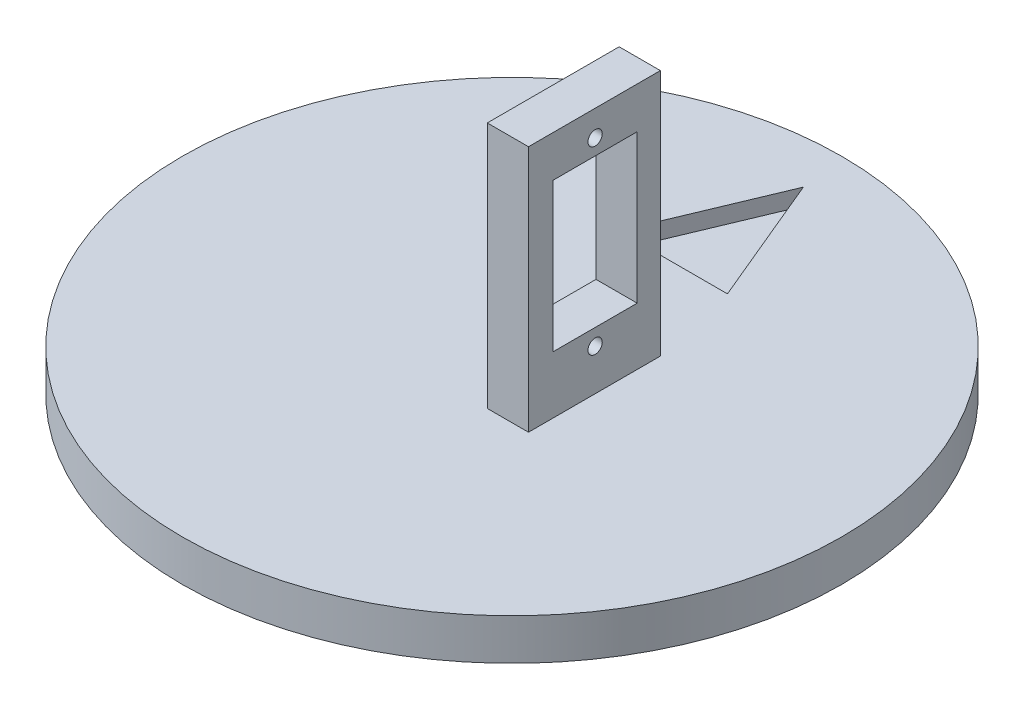
ISO-10303-21;
HEADER;
FILE_DESCRIPTION(('STEP AP214'),'2;1');
FILE_NAME('part.step','',(''),(''),'','','');
FILE_SCHEMA(('AUTOMOTIVE_DESIGN { 1 0 10303 214 1 1 1 1 }'));
ENDSEC;
DATA;
#1=APPLICATION_CONTEXT('core data for automotive mechanical design processes');
#2=APPLICATION_PROTOCOL_DEFINITION('international standard','automotive_design',2000,#1);
#3=PRODUCT_CONTEXT('',#1,'mechanical');
#4=PRODUCT('Part','Part','',(#3));
#5=PRODUCT_RELATED_PRODUCT_CATEGORY('part','',(#4));
#6=PRODUCT_DEFINITION_FORMATION('','',#4);
#7=PRODUCT_DEFINITION_CONTEXT('part definition',#1,'design');
#8=PRODUCT_DEFINITION('design','',#6,#7);
#9=PRODUCT_DEFINITION_SHAPE('','',#8);
#10=(LENGTH_UNIT() NAMED_UNIT(*) SI_UNIT(.MILLI.,.METRE.));
#11=(NAMED_UNIT(*) PLANE_ANGLE_UNIT() SI_UNIT($,.RADIAN.));
#12=(NAMED_UNIT(*) SI_UNIT($,.STERADIAN.) SOLID_ANGLE_UNIT());
#13=UNCERTAINTY_MEASURE_WITH_UNIT(LENGTH_MEASURE(1.E-05),#10,'distance_accuracy_value','');
#14=(GEOMETRIC_REPRESENTATION_CONTEXT(3) GLOBAL_UNCERTAINTY_ASSIGNED_CONTEXT((#13)) GLOBAL_UNIT_ASSIGNED_CONTEXT((#10,
#11,#12)) REPRESENTATION_CONTEXT('',''));
#15=CARTESIAN_POINT('',(0.,0.,0.));
#16=DIRECTION('',(0.,0.,1.));
#17=DIRECTION('',(1.,0.,0.));
#18=AXIS2_PLACEMENT_3D('',#15,#16,#17);
#19=CARTESIAN_POINT('',(0.,6.35,0.));
#20=DIRECTION('',(0.,-1.,0.));
#21=DIRECTION('',(0.,0.,-1.));
#22=AXIS2_PLACEMENT_3D('',#19,#20,#21);
#23=CYLINDRICAL_SURFACE('',#22,50.8);
#24=CARTESIAN_POINT('',(0.,6.35,0.));
#25=DIRECTION('',(0.,1.,0.));
#26=DIRECTION('',(0.,0.,1.));
#27=AXIS2_PLACEMENT_3D('',#24,#25,#26);
#28=CIRCLE('',#27,50.8);
#29=CARTESIAN_POINT('',(0.,6.35,50.8));
#30=VERTEX_POINT('',#29);
#31=EDGE_CURVE('E11',#30,#30,#28,.T.);
#32=ORIENTED_EDGE('',*,*,#31,.F.);
#33=EDGE_LOOP('',(#32));
#34=FACE_BOUND('',#33,.T.);
#35=CARTESIAN_POINT('',(0.,0.,0.));
#36=DIRECTION('',(0.,1.,0.));
#37=DIRECTION('',(0.,0.,1.));
#38=AXIS2_PLACEMENT_3D('',#35,#36,#37);
#39=CIRCLE('',#38,50.8);
#40=CARTESIAN_POINT('',(0.,0.,50.8));
#41=VERTEX_POINT('',#40);
#42=EDGE_CURVE('E45',#41,#41,#39,.T.);
#43=ORIENTED_EDGE('',*,*,#42,.T.);
#44=EDGE_LOOP('',(#43));
#45=FACE_BOUND('',#44,.T.);
#46=ADVANCED_FACE('F42',(#34,#45),#23,.T.);
#47=CARTESIAN_POINT('',(0.,6.35,0.));
#48=DIRECTION('',(0.,1.,0.));
#49=DIRECTION('',(0.,0.,1.));
#50=AXIS2_PLACEMENT_3D('',#47,#48,#49);
#51=PLANE('',#50);
#52=DIRECTION('',(-0.385564685443145,0.,0.922680807939088));
#53=VECTOR('',#52,1.);
#54=CARTESIAN_POINT('',(1.16472130618915,6.35,-43.7255790365176));
#55=LINE('',#54,#53);
#56=CARTESIAN_POINT('',(1.16472130618915,6.35,-43.7255790365176));
#57=VERTEX_POINT('',#56);
#58=CARTESIAN_POINT('',(-7.23097810925763,6.35,-23.6341365047547));
#59=VERTEX_POINT('',#58);
#60=EDGE_CURVE('E57',#57,#59,#55,.T.);
#61=ORIENTED_EDGE('',*,*,#60,.F.);
#62=DIRECTION('',(-0.385564685443145,0.,-0.922680807939088));
#63=VECTOR('',#62,1.);
#64=CARTESIAN_POINT('',(9.56042072163593,6.35,-23.6341365047547));
#65=LINE('',#64,#63);
#66=CARTESIAN_POINT('',(9.56042072163593,6.35,-23.6341365047547));
#67=VERTEX_POINT('',#66);
#68=EDGE_CURVE('E145',#67,#57,#65,.T.);
#69=ORIENTED_EDGE('',*,*,#68,.F.);
#70=DIRECTION('',(1.,0.,0.));
#71=VECTOR('',#70,1.);
#72=CARTESIAN_POINT('',(-7.23097810925763,6.35,-23.6341365047547));
#73=LINE('',#72,#71);
#74=EDGE_CURVE('E149',#59,#67,#73,.T.);
#75=ORIENTED_EDGE('',*,*,#74,.F.);
#76=EDGE_LOOP('',(#61,#69,#75));
#77=FACE_BOUND('',#76,.T.);
#78=DIRECTION('',(0.,0.,1.));
#79=VECTOR('',#78,1.);
#80=CARTESIAN_POINT('',(12.7,6.35,-10.16));
#81=LINE('',#80,#79);
#82=CARTESIAN_POINT('',(12.7,6.35,-10.16));
#83=VERTEX_POINT('',#82);
#84=CARTESIAN_POINT('',(12.7,6.35,10.16));
#85=VERTEX_POINT('',#84);
#86=EDGE_CURVE('E217',#83,#85,#81,.T.);
#87=ORIENTED_EDGE('',*,*,#86,.T.);
#88=DIRECTION('',(-1.,0.,0.));
#89=VECTOR('',#88,1.);
#90=CARTESIAN_POINT('',(12.7,6.35,10.16));
#91=LINE('',#90,#89);
#92=CARTESIAN_POINT('',(6.35,6.35,10.16));
#93=VERTEX_POINT('',#92);
#94=EDGE_CURVE('E236',#85,#93,#91,.T.);
#95=ORIENTED_EDGE('',*,*,#94,.T.);
#96=DIRECTION('',(0.,0.,1.));
#97=VECTOR('',#96,1.);
#98=CARTESIAN_POINT('',(6.35,6.35,-10.16));
#99=LINE('',#98,#97);
#100=CARTESIAN_POINT('',(6.35,6.35,-10.16));
#101=VERTEX_POINT('',#100);
#102=EDGE_CURVE('E239',#101,#93,#99,.T.);
#103=ORIENTED_EDGE('',*,*,#102,.F.);
#104=DIRECTION('',(-1.,0.,0.));
#105=VECTOR('',#104,1.);
#106=CARTESIAN_POINT('',(12.7,6.35,-10.16));
#107=LINE('',#106,#105);
#108=EDGE_CURVE('E223',#83,#101,#107,.T.);
#109=ORIENTED_EDGE('',*,*,#108,.F.);
#110=EDGE_LOOP('',(#87,#95,#103,#109));
#111=FACE_BOUND('',#110,.T.);
#112=ORIENTED_EDGE('',*,*,#31,.T.);
#113=EDGE_LOOP('',(#112));
#114=FACE_BOUND('',#113,.T.);
#115=ADVANCED_FACE('F270',(#77,#111,#114),#51,.T.);
#116=CARTESIAN_POINT('',(0.,0.,0.));
#117=DIRECTION('',(0.,1.,0.));
#118=DIRECTION('',(0.,0.,1.));
#119=AXIS2_PLACEMENT_3D('',#116,#117,#118);
#120=PLANE('',#119);
#121=ORIENTED_EDGE('',*,*,#42,.F.);
#122=EDGE_LOOP('',(#121));
#123=FACE_BOUND('',#122,.T.);
#124=ADVANCED_FACE('F300',(#123),#120,.F.);
#125=CARTESIAN_POINT('',(12.7,44.45,-10.16));
#126=DIRECTION('',(1.,0.,0.));
#127=DIRECTION('',(0.,0.,-1.));
#128=AXIS2_PLACEMENT_3D('',#125,#126,#127);
#129=PLANE('',#128);
#130=CARTESIAN_POINT('',(12.7,12.7,-0.107309117776067));
#131=DIRECTION('',(1.,0.,0.));
#132=DIRECTION('',(0.,0.,-1.));
#133=AXIS2_PLACEMENT_3D('',#130,#131,#132);
#134=CIRCLE('',#133,1.09999999999311);
#135=CARTESIAN_POINT('',(12.7,12.7,-1.20730911776918));
#136=VERTEX_POINT('',#135);
#137=EDGE_CURVE('E213',#136,#136,#134,.T.);
#138=ORIENTED_EDGE('',*,*,#137,.F.);
#139=EDGE_LOOP('',(#138));
#140=FACE_BOUND('',#139,.T.);
#141=CARTESIAN_POINT('',(12.7,40.5,-0.107309117776262));
#142=DIRECTION('',(1.,0.,0.));
#143=DIRECTION('',(0.,0.,-1.));
#144=AXIS2_PLACEMENT_3D('',#141,#142,#143);
#145=CIRCLE('',#144,1.09999999999311);
#146=CARTESIAN_POINT('',(12.7,40.5,-1.20730911776937));
#147=VERTEX_POINT('',#146);
#148=EDGE_CURVE('E209',#147,#147,#145,.T.);
#149=ORIENTED_EDGE('',*,*,#148,.F.);
#150=EDGE_LOOP('',(#149));
#151=FACE_BOUND('',#150,.T.);
#152=DIRECTION('',(0.,1.,0.));
#153=VECTOR('',#152,1.);
#154=CARTESIAN_POINT('',(12.7,44.45,-6.58991986930291));
#155=LINE('',#154,#153);
#156=CARTESIAN_POINT('',(12.7,15.1976912798329,-6.58991986930291));
#157=VERTEX_POINT('',#156);
#158=CARTESIAN_POINT('',(12.7,38.0793459125457,-6.58991986930291));
#159=VERTEX_POINT('',#158);
#160=EDGE_CURVE('E206',#157,#159,#155,.T.);
#161=ORIENTED_EDGE('',*,*,#160,.F.);
#162=DIRECTION('',(0.,0.,-1.));
#163=VECTOR('',#162,1.);
#164=CARTESIAN_POINT('',(12.7,15.1976912798329,-10.16));
#165=LINE('',#164,#163);
#166=CARTESIAN_POINT('',(12.7,15.1976912798329,6.35000000000001));
#167=VERTEX_POINT('',#166);
#168=EDGE_CURVE('E189',#167,#157,#165,.T.);
#169=ORIENTED_EDGE('',*,*,#168,.F.);
#170=DIRECTION('',(0.,-1.,0.));
#171=VECTOR('',#170,1.);
#172=CARTESIAN_POINT('',(12.7,44.45,6.35));
#173=LINE('',#172,#171);
#174=CARTESIAN_POINT('',(12.7,38.0793459125457,6.35));
#175=VERTEX_POINT('',#174);
#176=EDGE_CURVE('E200',#175,#167,#173,.T.);
#177=ORIENTED_EDGE('',*,*,#176,.F.);
#178=DIRECTION('',(0.,0.,1.));
#179=VECTOR('',#178,1.);
#180=CARTESIAN_POINT('',(12.7,38.0793459125457,-10.16));
#181=LINE('',#180,#179);
#182=EDGE_CURVE('E203',#159,#175,#181,.T.);
#183=ORIENTED_EDGE('',*,*,#182,.F.);
#184=EDGE_LOOP('',(#161,#169,#177,#183));
#185=FACE_BOUND('',#184,.T.);
#186=ORIENTED_EDGE('',*,*,#86,.F.);
#187=DIRECTION('',(0.,-1.,0.));
#188=VECTOR('',#187,1.);
#189=CARTESIAN_POINT('',(12.7,44.45,-10.16));
#190=LINE('',#189,#188);
#191=CARTESIAN_POINT('',(12.7,44.45,-10.16));
#192=VERTEX_POINT('',#191);
#193=EDGE_CURVE('E246',#192,#83,#190,.T.);
#194=ORIENTED_EDGE('',*,*,#193,.F.);
#195=DIRECTION('',(0.,0.,1.));
#196=VECTOR('',#195,1.);
#197=CARTESIAN_POINT('',(12.7,44.45,-10.16));
#198=LINE('',#197,#196);
#199=CARTESIAN_POINT('',(12.7,44.45,10.16));
#200=VERTEX_POINT('',#199);
#201=EDGE_CURVE('E218',#192,#200,#198,.T.);
#202=ORIENTED_EDGE('',*,*,#201,.T.);
#203=DIRECTION('',(0.,-1.,0.));
#204=VECTOR('',#203,1.);
#205=CARTESIAN_POINT('',(12.7,44.45,10.16));
#206=LINE('',#205,#204);
#207=EDGE_CURVE('E233',#200,#85,#206,.T.);
#208=ORIENTED_EDGE('',*,*,#207,.T.);
#209=EDGE_LOOP('',(#186,#194,#202,#208));
#210=FACE_BOUND('',#209,.T.);
#211=ADVANCED_FACE('F263',(#140,#151,#185,#210),#129,.T.);
#212=CARTESIAN_POINT('',(12.7,44.45,-10.16));
#213=DIRECTION('',(0.,0.,1.));
#214=DIRECTION('',(1.,0.,0.));
#215=AXIS2_PLACEMENT_3D('',#212,#213,#214);
#216=PLANE('',#215);
#217=ORIENTED_EDGE('',*,*,#108,.T.);
#218=DIRECTION('',(0.,-1.,0.));
#219=VECTOR('',#218,1.);
#220=CARTESIAN_POINT('',(6.35,44.45,-10.16));
#221=LINE('',#220,#219);
#222=CARTESIAN_POINT('',(6.35,44.45,-10.16));
#223=VERTEX_POINT('',#222);
#224=EDGE_CURVE('E250',#223,#101,#221,.T.);
#225=ORIENTED_EDGE('',*,*,#224,.F.);
#226=DIRECTION('',(-1.,0.,0.));
#227=VECTOR('',#226,1.);
#228=CARTESIAN_POINT('',(12.7,44.45,-10.16));
#229=LINE('',#228,#227);
#230=EDGE_CURVE('E230',#192,#223,#229,.T.);
#231=ORIENTED_EDGE('',*,*,#230,.F.);
#232=ORIENTED_EDGE('',*,*,#193,.T.);
#233=EDGE_LOOP('',(#217,#225,#231,#232));
#234=FACE_BOUND('',#233,.T.);
#235=ADVANCED_FACE('F275',(#234),#216,.F.);
#236=CARTESIAN_POINT('',(6.35,44.45,-10.16));
#237=DIRECTION('',(1.,0.,0.));
#238=DIRECTION('',(0.,0.,-1.));
#239=AXIS2_PLACEMENT_3D('',#236,#237,#238);
#240=PLANE('',#239);
#241=CARTESIAN_POINT('',(6.35,12.7,-0.107309117776067));
#242=DIRECTION('',(-1.,0.,0.));
#243=DIRECTION('',(0.,0.,1.));
#244=AXIS2_PLACEMENT_3D('',#241,#242,#243);
#245=CIRCLE('',#244,1.09999999999311);
#246=CARTESIAN_POINT('',(6.35,12.7,0.992690882217046));
#247=VERTEX_POINT('',#246);
#248=EDGE_CURVE('E161',#247,#247,#245,.T.);
#249=ORIENTED_EDGE('',*,*,#248,.F.);
#250=EDGE_LOOP('',(#249));
#251=FACE_BOUND('',#250,.T.);
#252=CARTESIAN_POINT('',(6.35,40.5,-0.107309117776261));
#253=DIRECTION('',(-1.,0.,0.));
#254=DIRECTION('',(0.,0.,1.));
#255=AXIS2_PLACEMENT_3D('',#252,#253,#254);
#256=CIRCLE('',#255,1.09999999999311);
#257=CARTESIAN_POINT('',(6.35,40.5,0.992690882216852));
#258=VERTEX_POINT('',#257);
#259=EDGE_CURVE('E164',#258,#258,#256,.T.);
#260=ORIENTED_EDGE('',*,*,#259,.F.);
#261=EDGE_LOOP('',(#260));
#262=FACE_BOUND('',#261,.T.);
#263=DIRECTION('',(0.,0.,1.));
#264=VECTOR('',#263,1.);
#265=CARTESIAN_POINT('',(6.35,15.1976912798329,-6.58991986930291));
#266=LINE('',#265,#264);
#267=CARTESIAN_POINT('',(6.35,15.1976912798329,-6.58991986930291));
#268=VERTEX_POINT('',#267);
#269=CARTESIAN_POINT('',(6.35,15.1976912798329,6.35000000000001));
#270=VERTEX_POINT('',#269);
#271=EDGE_CURVE('E174',#268,#270,#266,.T.);
#272=ORIENTED_EDGE('',*,*,#271,.F.);
#273=DIRECTION('',(0.,-1.,0.));
#274=VECTOR('',#273,1.);
#275=CARTESIAN_POINT('',(6.35,38.0793459125457,-6.58991986930291));
#276=LINE('',#275,#274);
#277=CARTESIAN_POINT('',(6.35,38.0793459125457,-6.58991986930291));
#278=VERTEX_POINT('',#277);
#279=EDGE_CURVE('E168',#278,#268,#276,.T.);
#280=ORIENTED_EDGE('',*,*,#279,.F.);
#281=DIRECTION('',(0.,0.,-1.));
#282=VECTOR('',#281,1.);
#283=CARTESIAN_POINT('',(6.35,38.0793459125457,-6.58991986930291));
#284=LINE('',#283,#282);
#285=CARTESIAN_POINT('',(6.35,38.0793459125457,6.35));
#286=VERTEX_POINT('',#285);
#287=EDGE_CURVE('E181',#286,#278,#284,.T.);
#288=ORIENTED_EDGE('',*,*,#287,.F.);
#289=DIRECTION('',(0.,1.,0.));
#290=VECTOR('',#289,1.);
#291=CARTESIAN_POINT('',(6.35,38.0793459125457,6.35));
#292=LINE('',#291,#290);
#293=EDGE_CURVE('E177',#270,#286,#292,.T.);
#294=ORIENTED_EDGE('',*,*,#293,.F.);
#295=EDGE_LOOP('',(#272,#280,#288,#294));
#296=FACE_BOUND('',#295,.T.);
#297=ORIENTED_EDGE('',*,*,#102,.T.);
#298=DIRECTION('',(0.,-1.,0.));
#299=VECTOR('',#298,1.);
#300=CARTESIAN_POINT('',(6.35,44.45,10.16));
#301=LINE('',#300,#299);
#302=CARTESIAN_POINT('',(6.35,44.45,10.16));
#303=VERTEX_POINT('',#302);
#304=EDGE_CURVE('E254',#303,#93,#301,.T.);
#305=ORIENTED_EDGE('',*,*,#304,.F.);
#306=DIRECTION('',(0.,0.,1.));
#307=VECTOR('',#306,1.);
#308=CARTESIAN_POINT('',(6.35,44.45,-10.16));
#309=LINE('',#308,#307);
#310=EDGE_CURVE('E227',#223,#303,#309,.T.);
#311=ORIENTED_EDGE('',*,*,#310,.F.);
#312=ORIENTED_EDGE('',*,*,#224,.T.);
#313=EDGE_LOOP('',(#297,#305,#311,#312));
#314=FACE_BOUND('',#313,.T.);
#315=ADVANCED_FACE('F280',(#251,#262,#296,#314),#240,.F.);
#316=CARTESIAN_POINT('',(12.7,44.45,10.16));
#317=DIRECTION('',(0.,0.,1.));
#318=DIRECTION('',(1.,0.,0.));
#319=AXIS2_PLACEMENT_3D('',#316,#317,#318);
#320=PLANE('',#319);
#321=ORIENTED_EDGE('',*,*,#94,.F.);
#322=ORIENTED_EDGE('',*,*,#207,.F.);
#323=DIRECTION('',(-1.,0.,0.));
#324=VECTOR('',#323,1.);
#325=CARTESIAN_POINT('',(12.7,44.45,10.16));
#326=LINE('',#325,#324);
#327=EDGE_CURVE('E222',#200,#303,#326,.T.);
#328=ORIENTED_EDGE('',*,*,#327,.T.);
#329=ORIENTED_EDGE('',*,*,#304,.T.);
#330=EDGE_LOOP('',(#321,#322,#328,#329));
#331=FACE_BOUND('',#330,.T.);
#332=ADVANCED_FACE('F267',(#331),#320,.T.);
#333=CARTESIAN_POINT('',(0.,44.45,0.));
#334=DIRECTION('',(0.,-1.,0.));
#335=DIRECTION('',(0.,0.,-1.));
#336=AXIS2_PLACEMENT_3D('',#333,#334,#335);
#337=PLANE('',#336);
#338=ORIENTED_EDGE('',*,*,#201,.F.);
#339=ORIENTED_EDGE('',*,*,#230,.T.);
#340=ORIENTED_EDGE('',*,*,#310,.T.);
#341=ORIENTED_EDGE('',*,*,#327,.F.);
#342=EDGE_LOOP('',(#338,#339,#340,#341));
#343=FACE_BOUND('',#342,.T.);
#344=ADVANCED_FACE('F278',(#343),#337,.F.);
#345=CARTESIAN_POINT('',(19.05,38.0793459125457,-6.58991986930291));
#346=DIRECTION('',(0.,0.,-1.));
#347=DIRECTION('',(-1.,0.,0.));
#348=AXIS2_PLACEMENT_3D('',#345,#346,#347);
#349=PLANE('',#348);
#350=ORIENTED_EDGE('',*,*,#160,.T.);
#351=DIRECTION('',(-1.,0.,0.));
#352=VECTOR('',#351,1.);
#353=CARTESIAN_POINT('',(19.05,38.0793459125457,-6.58991986930291));
#354=LINE('',#353,#352);
#355=EDGE_CURVE('E186',#159,#278,#354,.T.);
#356=ORIENTED_EDGE('',*,*,#355,.T.);
#357=ORIENTED_EDGE('',*,*,#279,.T.);
#358=DIRECTION('',(-1.,0.,0.));
#359=VECTOR('',#358,1.);
#360=CARTESIAN_POINT('',(19.05,15.1976912798329,-6.58991986930291));
#361=LINE('',#360,#359);
#362=EDGE_CURVE('E185',#157,#268,#361,.T.);
#363=ORIENTED_EDGE('',*,*,#362,.F.);
#364=EDGE_LOOP('',(#350,#356,#357,#363));
#365=FACE_BOUND('',#364,.T.);
#366=ADVANCED_FACE('F328',(#365),#349,.F.);
#367=CARTESIAN_POINT('',(19.05,38.0793459125457,-6.58991986930291));
#368=DIRECTION('',(0.,1.,0.));
#369=DIRECTION('',(0.,0.,1.));
#370=AXIS2_PLACEMENT_3D('',#367,#368,#369);
#371=PLANE('',#370);
#372=ORIENTED_EDGE('',*,*,#182,.T.);
#373=DIRECTION('',(-1.,0.,0.));
#374=VECTOR('',#373,1.);
#375=CARTESIAN_POINT('',(19.05,38.0793459125457,6.35));
#376=LINE('',#375,#374);
#377=EDGE_CURVE('E190',#175,#286,#376,.T.);
#378=ORIENTED_EDGE('',*,*,#377,.T.);
#379=ORIENTED_EDGE('',*,*,#287,.T.);
#380=ORIENTED_EDGE('',*,*,#355,.F.);
#381=EDGE_LOOP('',(#372,#378,#379,#380));
#382=FACE_BOUND('',#381,.T.);
#383=ADVANCED_FACE('F330',(#382),#371,.F.);
#384=CARTESIAN_POINT('',(19.05,38.0793459125457,6.35));
#385=DIRECTION('',(0.,0.,1.));
#386=DIRECTION('',(0.,-1.,0.));
#387=AXIS2_PLACEMENT_3D('',#384,#385,#386);
#388=PLANE('',#387);
#389=ORIENTED_EDGE('',*,*,#176,.T.);
#390=DIRECTION('',(-1.,0.,0.));
#391=VECTOR('',#390,1.);
#392=CARTESIAN_POINT('',(19.05,15.1976912798329,6.35000000000001));
#393=LINE('',#392,#391);
#394=EDGE_CURVE('E65',#167,#270,#393,.T.);
#395=ORIENTED_EDGE('',*,*,#394,.T.);
#396=ORIENTED_EDGE('',*,*,#293,.T.);
#397=ORIENTED_EDGE('',*,*,#377,.F.);
#398=EDGE_LOOP('',(#389,#395,#396,#397));
#399=FACE_BOUND('',#398,.T.);
#400=ADVANCED_FACE('F339',(#399),#388,.F.);
#401=CARTESIAN_POINT('',(19.05,15.1976912798329,-6.58991986930291));
#402=DIRECTION('',(0.,-1.,0.));
#403=DIRECTION('',(0.,0.,-1.));
#404=AXIS2_PLACEMENT_3D('',#401,#402,#403);
#405=PLANE('',#404);
#406=ORIENTED_EDGE('',*,*,#168,.T.);
#407=ORIENTED_EDGE('',*,*,#362,.T.);
#408=ORIENTED_EDGE('',*,*,#271,.T.);
#409=ORIENTED_EDGE('',*,*,#394,.F.);
#410=EDGE_LOOP('',(#406,#407,#408,#409));
#411=FACE_BOUND('',#410,.T.);
#412=ADVANCED_FACE('F337',(#411),#405,.F.);
#413=CARTESIAN_POINT('',(19.05,40.5,-0.107309117776262));
#414=DIRECTION('',(-1.,0.,0.));
#415=DIRECTION('',(0.,0.,1.));
#416=AXIS2_PLACEMENT_3D('',#413,#414,#415);
#417=CYLINDRICAL_SURFACE('',#416,1.09999999999311);
#418=ORIENTED_EDGE('',*,*,#148,.T.);
#419=EDGE_LOOP('',(#418));
#420=FACE_BOUND('',#419,.T.);
#421=ORIENTED_EDGE('',*,*,#259,.T.);
#422=EDGE_LOOP('',(#421));
#423=FACE_BOUND('',#422,.T.);
#424=ADVANCED_FACE('F346',(#420,#423),#417,.F.);
#425=CARTESIAN_POINT('',(19.05,12.7,-0.107309117776068));
#426=DIRECTION('',(-1.,0.,0.));
#427=DIRECTION('',(0.,0.,1.));
#428=AXIS2_PLACEMENT_3D('',#425,#426,#427);
#429=CYLINDRICAL_SURFACE('',#428,1.09999999999311);
#430=ORIENTED_EDGE('',*,*,#137,.T.);
#431=EDGE_LOOP('',(#430));
#432=FACE_BOUND('',#431,.T.);
#433=ORIENTED_EDGE('',*,*,#248,.T.);
#434=EDGE_LOOP('',(#433));
#435=FACE_BOUND('',#434,.T.);
#436=ADVANCED_FACE('F386',(#432,#435),#429,.F.);
#437=CARTESIAN_POINT('',(1.16472130618915,3.81,-43.7255790365176));
#438=DIRECTION('',(-0.922680807939088,0.,-0.385564685443145));
#439=DIRECTION('',(-0.385564685443145,0.,0.922680807939088));
#440=AXIS2_PLACEMENT_3D('',#437,#438,#439);
#441=PLANE('',#440);
#442=ORIENTED_EDGE('',*,*,#60,.T.);
#443=DIRECTION('',(0.,1.,0.));
#444=VECTOR('',#443,1.);
#445=CARTESIAN_POINT('',(-7.23097810925763,3.81,-23.6341365047547));
#446=LINE('',#445,#444);
#447=CARTESIAN_POINT('',(-7.23097810925763,3.81,-23.6341365047547));
#448=VERTEX_POINT('',#447);
#449=EDGE_CURVE('E123',#448,#59,#446,.T.);
#450=ORIENTED_EDGE('',*,*,#449,.F.);
#451=DIRECTION('',(-0.385564685443145,0.,0.922680807939088));
#452=VECTOR('',#451,1.);
#453=CARTESIAN_POINT('',(1.16472130618915,3.81,-43.7255790365176));
#454=LINE('',#453,#452);
#455=CARTESIAN_POINT('',(1.16472130618915,3.81,-43.7255790365176));
#456=VERTEX_POINT('',#455);
#457=EDGE_CURVE('E127',#456,#448,#454,.T.);
#458=ORIENTED_EDGE('',*,*,#457,.F.);
#459=DIRECTION('',(0.,1.,0.));
#460=VECTOR('',#459,1.);
#461=CARTESIAN_POINT('',(1.16472130618915,3.81,-43.7255790365176));
#462=LINE('',#461,#460);
#463=EDGE_CURVE('E158',#456,#57,#462,.T.);
#464=ORIENTED_EDGE('',*,*,#463,.T.);
#465=EDGE_LOOP('',(#442,#450,#458,#464));
#466=FACE_BOUND('',#465,.T.);
#467=ADVANCED_FACE('F125',(#466),#441,.F.);
#468=CARTESIAN_POINT('',(9.56042072163593,3.81,-23.6341365047547));
#469=DIRECTION('',(0.922680807939088,0.,-0.385564685443145));
#470=DIRECTION('',(-0.385564685443145,0.,-0.922680807939088));
#471=AXIS2_PLACEMENT_3D('',#468,#469,#470);
#472=PLANE('',#471);
#473=ORIENTED_EDGE('',*,*,#68,.T.);
#474=ORIENTED_EDGE('',*,*,#463,.F.);
#475=DIRECTION('',(-0.385564685443145,0.,-0.922680807939088));
#476=VECTOR('',#475,1.);
#477=CARTESIAN_POINT('',(9.56042072163593,3.81,-23.6341365047547));
#478=LINE('',#477,#476);
#479=CARTESIAN_POINT('',(9.56042072163593,3.81,-23.6341365047547));
#480=VERTEX_POINT('',#479);
#481=EDGE_CURVE('E134',#480,#456,#478,.T.);
#482=ORIENTED_EDGE('',*,*,#481,.F.);
#483=DIRECTION('',(0.,1.,0.));
#484=VECTOR('',#483,1.);
#485=CARTESIAN_POINT('',(9.56042072163593,3.81,-23.6341365047547));
#486=LINE('',#485,#484);
#487=EDGE_CURVE('E133',#480,#67,#486,.T.);
#488=ORIENTED_EDGE('',*,*,#487,.T.);
#489=EDGE_LOOP('',(#473,#474,#482,#488));
#490=FACE_BOUND('',#489,.T.);
#491=ADVANCED_FACE('F409',(#490),#472,.F.);
#492=CARTESIAN_POINT('',(-7.23097810925763,3.81,-23.6341365047547));
#493=DIRECTION('',(0.,0.,1.));
#494=DIRECTION('',(1.,0.,0.));
#495=AXIS2_PLACEMENT_3D('',#492,#493,#494);
#496=PLANE('',#495);
#497=ORIENTED_EDGE('',*,*,#74,.T.);
#498=ORIENTED_EDGE('',*,*,#487,.F.);
#499=DIRECTION('',(1.,0.,0.));
#500=VECTOR('',#499,1.);
#501=CARTESIAN_POINT('',(-7.23097810925763,3.81,-23.6341365047547));
#502=LINE('',#501,#500);
#503=EDGE_CURVE('E137',#448,#480,#502,.T.);
#504=ORIENTED_EDGE('',*,*,#503,.F.);
#505=ORIENTED_EDGE('',*,*,#449,.T.);
#506=EDGE_LOOP('',(#497,#498,#504,#505));
#507=FACE_BOUND('',#506,.T.);
#508=ADVANCED_FACE('F138',(#507),#496,.F.);
#509=CARTESIAN_POINT('',(0.,3.81,0.));
#510=DIRECTION('',(0.,1.,0.));
#511=DIRECTION('',(0.,0.,1.));
#512=AXIS2_PLACEMENT_3D('',#509,#510,#511);
#513=PLANE('',#512);
#514=ORIENTED_EDGE('',*,*,#457,.T.);
#515=ORIENTED_EDGE('',*,*,#503,.T.);
#516=ORIENTED_EDGE('',*,*,#481,.T.);
#517=EDGE_LOOP('',(#514,#515,#516));
#518=FACE_BOUND('',#517,.T.);
#519=ADVANCED_FACE('F143',(#518),#513,.T.);
#520=CLOSED_SHELL('',(#46,#115,#124,#211,#235,#315,#332,#344,#366,#383,#400,#412,#424,#436,#467,
#491,#508,#519));
#521=MANIFOLD_SOLID_BREP('B2',#520);
#522=ADVANCED_BREP_SHAPE_REPRESENTATION('',(#18,#521),#14);
#523=SHAPE_DEFINITION_REPRESENTATION(#9,#522);
ENDSEC;
END-ISO-10303-21;
